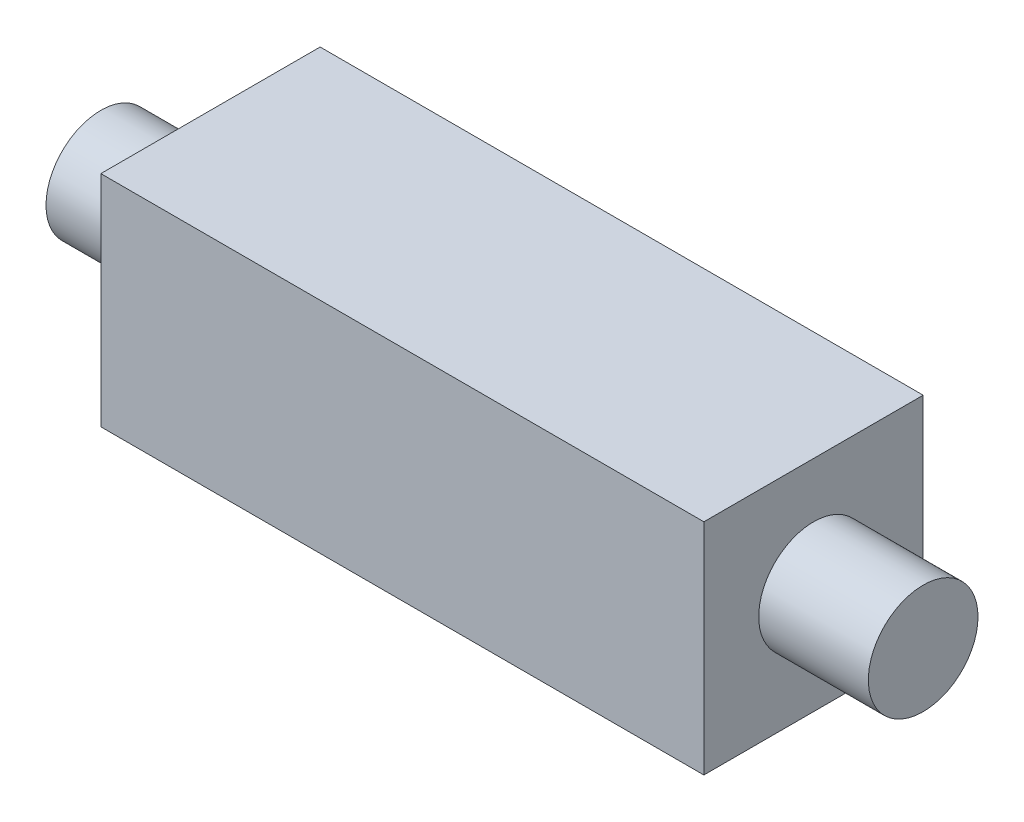
ISO-10303-21;
HEADER;
FILE_DESCRIPTION(('STEP AP214'),'2;1');
FILE_NAME('part.step','',(''),(''),'','','');
FILE_SCHEMA(('AUTOMOTIVE_DESIGN { 1 0 10303 214 1 1 1 1 }'));
ENDSEC;
DATA;
#1=APPLICATION_CONTEXT('core data for automotive mechanical design processes');
#2=APPLICATION_PROTOCOL_DEFINITION('international standard','automotive_design',2000,#1);
#3=PRODUCT_CONTEXT('',#1,'mechanical');
#4=PRODUCT('Part','Part','',(#3));
#5=PRODUCT_RELATED_PRODUCT_CATEGORY('part','',(#4));
#6=PRODUCT_DEFINITION_FORMATION('','',#4);
#7=PRODUCT_DEFINITION_CONTEXT('part definition',#1,'design');
#8=PRODUCT_DEFINITION('design','',#6,#7);
#9=PRODUCT_DEFINITION_SHAPE('','',#8);
#10=(LENGTH_UNIT() NAMED_UNIT(*) SI_UNIT(.MILLI.,.METRE.));
#11=(NAMED_UNIT(*) PLANE_ANGLE_UNIT() SI_UNIT($,.RADIAN.));
#12=(NAMED_UNIT(*) SI_UNIT($,.STERADIAN.) SOLID_ANGLE_UNIT());
#13=UNCERTAINTY_MEASURE_WITH_UNIT(LENGTH_MEASURE(1.E-05),#10,'distance_accuracy_value','');
#14=(GEOMETRIC_REPRESENTATION_CONTEXT(3) GLOBAL_UNCERTAINTY_ASSIGNED_CONTEXT((#13)) GLOBAL_UNIT_ASSIGNED_CONTEXT((#10,
#11,#12)) REPRESENTATION_CONTEXT('',''));
#15=CARTESIAN_POINT('',(0.,0.,0.));
#16=DIRECTION('',(0.,0.,1.));
#17=DIRECTION('',(1.,0.,0.));
#18=AXIS2_PLACEMENT_3D('',#15,#16,#17);
#19=CARTESIAN_POINT('',(5.5,4.,-2.));
#20=DIRECTION('',(-1.,0.,0.));
#21=DIRECTION('',(0.,0.,1.));
#22=AXIS2_PLACEMENT_3D('',#19,#20,#21);
#23=PLANE('',#22);
#24=CARTESIAN_POINT('',(5.5,2.,0.));
#25=DIRECTION('',(1.,0.,0.));
#26=DIRECTION('',(0.,0.,-1.));
#27=AXIS2_PLACEMENT_3D('',#24,#25,#26);
#28=CIRCLE('',#27,1.);
#29=CARTESIAN_POINT('',(5.5,2.,-1.));
#30=VERTEX_POINT('',#29);
#31=EDGE_CURVE('E49',#30,#30,#28,.T.);
#32=ORIENTED_EDGE('',*,*,#31,.F.);
#33=EDGE_LOOP('',(#32));
#34=FACE_BOUND('',#33,.T.);
#35=DIRECTION('',(0.,0.,-1.));
#36=VECTOR('',#35,1.);
#37=CARTESIAN_POINT('',(5.5,0.,-2.));
#38=LINE('',#37,#36);
#39=CARTESIAN_POINT('',(5.5,0.,2.));
#40=VERTEX_POINT('',#39);
#41=CARTESIAN_POINT('',(5.5,0.,-2.));
#42=VERTEX_POINT('',#41);
#43=EDGE_CURVE('E111',#40,#42,#38,.T.);
#44=ORIENTED_EDGE('',*,*,#43,.T.);
#45=DIRECTION('',(0.,-1.,0.));
#46=VECTOR('',#45,1.);
#47=CARTESIAN_POINT('',(5.5,4.,-2.));
#48=LINE('',#47,#46);
#49=CARTESIAN_POINT('',(5.5,4.,-2.));
#50=VERTEX_POINT('',#49);
#51=EDGE_CURVE('E42',#50,#42,#48,.T.);
#52=ORIENTED_EDGE('',*,*,#51,.F.);
#53=DIRECTION('',(0.,0.,-1.));
#54=VECTOR('',#53,1.);
#55=CARTESIAN_POINT('',(5.5,4.,-2.));
#56=LINE('',#55,#54);
#57=CARTESIAN_POINT('',(5.5,4.,2.));
#58=VERTEX_POINT('',#57);
#59=EDGE_CURVE('E94',#58,#50,#56,.T.);
#60=ORIENTED_EDGE('',*,*,#59,.F.);
#61=DIRECTION('',(0.,-1.,0.));
#62=VECTOR('',#61,1.);
#63=CARTESIAN_POINT('',(5.5,4.,2.));
#64=LINE('',#63,#62);
#65=EDGE_CURVE('E107',#58,#40,#64,.T.);
#66=ORIENTED_EDGE('',*,*,#65,.T.);
#67=EDGE_LOOP('',(#44,#52,#60,#66));
#68=FACE_BOUND('',#67,.T.);
#69=ADVANCED_FACE('F39',(#34,#68),#23,.F.);
#70=CARTESIAN_POINT('',(-5.5,4.,-2.));
#71=DIRECTION('',(0.,0.,1.));
#72=DIRECTION('',(1.,0.,0.));
#73=AXIS2_PLACEMENT_3D('',#70,#71,#72);
#74=PLANE('',#73);
#75=DIRECTION('',(-1.,0.,0.));
#76=VECTOR('',#75,1.);
#77=CARTESIAN_POINT('',(-5.5,0.,-2.));
#78=LINE('',#77,#76);
#79=CARTESIAN_POINT('',(-5.5,0.,-2.));
#80=VERTEX_POINT('',#79);
#81=EDGE_CURVE('E100',#42,#80,#78,.T.);
#82=ORIENTED_EDGE('',*,*,#81,.T.);
#83=DIRECTION('',(0.,-1.,0.));
#84=VECTOR('',#83,1.);
#85=CARTESIAN_POINT('',(-5.5,4.,-2.));
#86=LINE('',#85,#84);
#87=CARTESIAN_POINT('',(-5.5,4.,-2.));
#88=VERTEX_POINT('',#87);
#89=EDGE_CURVE('E98',#88,#80,#86,.T.);
#90=ORIENTED_EDGE('',*,*,#89,.F.);
#91=DIRECTION('',(-1.,0.,0.));
#92=VECTOR('',#91,1.);
#93=CARTESIAN_POINT('',(-5.5,4.,-2.));
#94=LINE('',#93,#92);
#95=EDGE_CURVE('E89',#50,#88,#94,.T.);
#96=ORIENTED_EDGE('',*,*,#95,.F.);
#97=ORIENTED_EDGE('',*,*,#51,.T.);
#98=EDGE_LOOP('',(#82,#90,#96,#97));
#99=FACE_BOUND('',#98,.T.);
#100=ADVANCED_FACE('F99',(#99),#74,.F.);
#101=CARTESIAN_POINT('',(-5.5,4.,-2.));
#102=DIRECTION('',(1.,0.,0.));
#103=DIRECTION('',(0.,0.,-1.));
#104=AXIS2_PLACEMENT_3D('',#101,#102,#103);
#105=PLANE('',#104);
#106=CARTESIAN_POINT('',(-5.5,2.,0.));
#107=DIRECTION('',(-1.,0.,0.));
#108=DIRECTION('',(0.,0.,1.));
#109=AXIS2_PLACEMENT_3D('',#106,#107,#108);
#110=CIRCLE('',#109,1.);
#111=CARTESIAN_POINT('',(-5.5,2.,1.));
#112=VERTEX_POINT('',#111);
#113=EDGE_CURVE('E11',#112,#112,#110,.T.);
#114=ORIENTED_EDGE('',*,*,#113,.F.);
#115=EDGE_LOOP('',(#114));
#116=FACE_BOUND('',#115,.T.);
#117=DIRECTION('',(0.,0.,1.));
#118=VECTOR('',#117,1.);
#119=CARTESIAN_POINT('',(-5.5,0.,-2.));
#120=LINE('',#119,#118);
#121=CARTESIAN_POINT('',(-5.5,0.,2.));
#122=VERTEX_POINT('',#121);
#123=EDGE_CURVE('E75',#80,#122,#120,.T.);
#124=ORIENTED_EDGE('',*,*,#123,.T.);
#125=DIRECTION('',(0.,-1.,0.));
#126=VECTOR('',#125,1.);
#127=CARTESIAN_POINT('',(-5.5,4.,2.));
#128=LINE('',#127,#126);
#129=CARTESIAN_POINT('',(-5.5,4.,2.));
#130=VERTEX_POINT('',#129);
#131=EDGE_CURVE('E102',#130,#122,#128,.T.);
#132=ORIENTED_EDGE('',*,*,#131,.F.);
#133=DIRECTION('',(0.,0.,1.));
#134=VECTOR('',#133,1.);
#135=CARTESIAN_POINT('',(-5.5,4.,-2.));
#136=LINE('',#135,#134);
#137=EDGE_CURVE('E92',#88,#130,#136,.T.);
#138=ORIENTED_EDGE('',*,*,#137,.F.);
#139=ORIENTED_EDGE('',*,*,#89,.T.);
#140=EDGE_LOOP('',(#124,#132,#138,#139));
#141=FACE_BOUND('',#140,.T.);
#142=ADVANCED_FACE('F103',(#116,#141),#105,.F.);
#143=CARTESIAN_POINT('',(-5.5,4.,2.));
#144=DIRECTION('',(0.,0.,-1.));
#145=DIRECTION('',(-1.,0.,0.));
#146=AXIS2_PLACEMENT_3D('',#143,#144,#145);
#147=PLANE('',#146);
#148=DIRECTION('',(1.,0.,0.));
#149=VECTOR('',#148,1.);
#150=CARTESIAN_POINT('',(-5.5,0.,2.));
#151=LINE('',#150,#149);
#152=EDGE_CURVE('E81',#122,#40,#151,.T.);
#153=ORIENTED_EDGE('',*,*,#152,.T.);
#154=ORIENTED_EDGE('',*,*,#65,.F.);
#155=DIRECTION('',(1.,0.,0.));
#156=VECTOR('',#155,1.);
#157=CARTESIAN_POINT('',(-5.5,4.,2.));
#158=LINE('',#157,#156);
#159=EDGE_CURVE('E58',#130,#58,#158,.T.);
#160=ORIENTED_EDGE('',*,*,#159,.F.);
#161=ORIENTED_EDGE('',*,*,#131,.T.);
#162=EDGE_LOOP('',(#153,#154,#160,#161));
#163=FACE_BOUND('',#162,.T.);
#164=ADVANCED_FACE('F125',(#163),#147,.F.);
#165=CARTESIAN_POINT('',(0.,4.,0.));
#166=DIRECTION('',(0.,1.,0.));
#167=DIRECTION('',(0.,0.,1.));
#168=AXIS2_PLACEMENT_3D('',#165,#166,#167);
#169=PLANE('',#168);
#170=ORIENTED_EDGE('',*,*,#59,.T.);
#171=ORIENTED_EDGE('',*,*,#95,.T.);
#172=ORIENTED_EDGE('',*,*,#137,.T.);
#173=ORIENTED_EDGE('',*,*,#159,.T.);
#174=EDGE_LOOP('',(#170,#171,#172,#173));
#175=FACE_BOUND('',#174,.T.);
#176=ADVANCED_FACE('F90',(#175),#169,.T.);
#177=CARTESIAN_POINT('',(0.,0.,0.));
#178=DIRECTION('',(0.,1.,0.));
#179=DIRECTION('',(0.,0.,1.));
#180=AXIS2_PLACEMENT_3D('',#177,#178,#179);
#181=PLANE('',#180);
#182=ORIENTED_EDGE('',*,*,#43,.F.);
#183=ORIENTED_EDGE('',*,*,#152,.F.);
#184=ORIENTED_EDGE('',*,*,#123,.F.);
#185=ORIENTED_EDGE('',*,*,#81,.F.);
#186=EDGE_LOOP('',(#182,#183,#184,#185));
#187=FACE_BOUND('',#186,.T.);
#188=ADVANCED_FACE('F128',(#187),#181,.F.);
#189=CARTESIAN_POINT('',(7.5,2.,0.));
#190=DIRECTION('',(-1.,0.,0.));
#191=DIRECTION('',(0.,0.,1.));
#192=AXIS2_PLACEMENT_3D('',#189,#190,#191);
#193=CYLINDRICAL_SURFACE('',#192,1.);
#194=CARTESIAN_POINT('',(7.5,2.,0.));
#195=DIRECTION('',(1.,0.,0.));
#196=DIRECTION('',(0.,0.,-1.));
#197=AXIS2_PLACEMENT_3D('',#194,#195,#196);
#198=CIRCLE('',#197,1.);
#199=CARTESIAN_POINT('',(7.5,2.,-1.));
#200=VERTEX_POINT('',#199);
#201=EDGE_CURVE('E115',#200,#200,#198,.T.);
#202=ORIENTED_EDGE('',*,*,#201,.F.);
#203=EDGE_LOOP('',(#202));
#204=FACE_BOUND('',#203,.T.);
#205=ORIENTED_EDGE('',*,*,#31,.T.);
#206=EDGE_LOOP('',(#205));
#207=FACE_BOUND('',#206,.T.);
#208=ADVANCED_FACE('F165',(#204,#207),#193,.T.);
#209=CARTESIAN_POINT('',(7.5,2.,0.));
#210=DIRECTION('',(1.,0.,0.));
#211=DIRECTION('',(0.,0.,-1.));
#212=AXIS2_PLACEMENT_3D('',#209,#210,#211);
#213=PLANE('',#212);
#214=ORIENTED_EDGE('',*,*,#201,.T.);
#215=EDGE_LOOP('',(#214));
#216=FACE_BOUND('',#215,.T.);
#217=ADVANCED_FACE('F148',(#216),#213,.T.);
#218=CARTESIAN_POINT('',(-7.5,2.,0.));
#219=DIRECTION('',(1.,0.,0.));
#220=DIRECTION('',(0.,0.,-1.));
#221=AXIS2_PLACEMENT_3D('',#218,#219,#220);
#222=CYLINDRICAL_SURFACE('',#221,1.);
#223=CARTESIAN_POINT('',(-7.5,2.,0.));
#224=DIRECTION('',(-1.,0.,0.));
#225=DIRECTION('',(0.,0.,1.));
#226=AXIS2_PLACEMENT_3D('',#223,#224,#225);
#227=CIRCLE('',#226,1.);
#228=CARTESIAN_POINT('',(-7.5,2.,1.));
#229=VERTEX_POINT('',#228);
#230=EDGE_CURVE('E137',#229,#229,#227,.T.);
#231=ORIENTED_EDGE('',*,*,#230,.F.);
#232=EDGE_LOOP('',(#231));
#233=FACE_BOUND('',#232,.T.);
#234=ORIENTED_EDGE('',*,*,#113,.T.);
#235=EDGE_LOOP('',(#234));
#236=FACE_BOUND('',#235,.T.);
#237=ADVANCED_FACE('F145',(#233,#236),#222,.T.);
#238=CARTESIAN_POINT('',(-7.5,2.,0.));
#239=DIRECTION('',(-1.,0.,0.));
#240=DIRECTION('',(0.,0.,1.));
#241=AXIS2_PLACEMENT_3D('',#238,#239,#240);
#242=PLANE('',#241);
#243=ORIENTED_EDGE('',*,*,#230,.T.);
#244=EDGE_LOOP('',(#243));
#245=FACE_BOUND('',#244,.T.);
#246=ADVANCED_FACE('F143',(#245),#242,.T.);
#247=CLOSED_SHELL('',(#69,#100,#142,#164,#176,#188,#208,#217,#237,#246));
#248=MANIFOLD_SOLID_BREP('B2',#247);
#249=ADVANCED_BREP_SHAPE_REPRESENTATION('',(#18,#248),#14);
#250=SHAPE_DEFINITION_REPRESENTATION(#9,#249);
ENDSEC;
END-ISO-10303-21;
